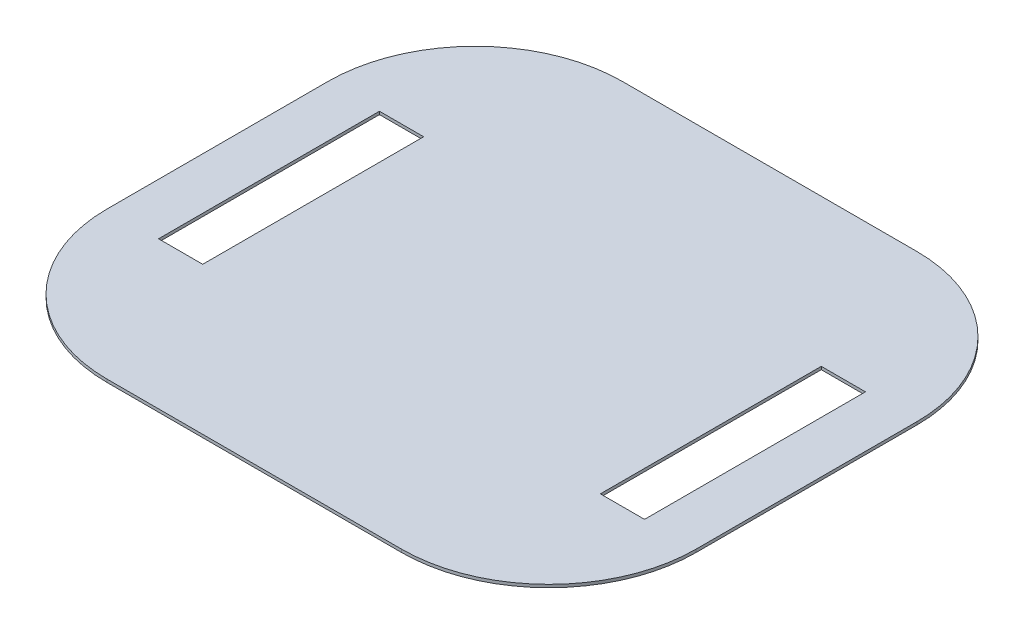
ISO-10303-21;
HEADER;
FILE_DESCRIPTION(('STEP AP214'),'2;1');
FILE_NAME('part.step','',(''),(''),'','','');
FILE_SCHEMA(('AUTOMOTIVE_DESIGN { 1 0 10303 214 1 1 1 1 }'));
ENDSEC;
DATA;
#1=APPLICATION_CONTEXT('core data for automotive mechanical design processes');
#2=APPLICATION_PROTOCOL_DEFINITION('international standard','automotive_design',2000,#1);
#3=PRODUCT_CONTEXT('',#1,'mechanical');
#4=PRODUCT('Part','Part','',(#3));
#5=PRODUCT_RELATED_PRODUCT_CATEGORY('part','',(#4));
#6=PRODUCT_DEFINITION_FORMATION('','',#4);
#7=PRODUCT_DEFINITION_CONTEXT('part definition',#1,'design');
#8=PRODUCT_DEFINITION('design','',#6,#7);
#9=PRODUCT_DEFINITION_SHAPE('','',#8);
#10=(LENGTH_UNIT() NAMED_UNIT(*) SI_UNIT(.MILLI.,.METRE.));
#11=(NAMED_UNIT(*) PLANE_ANGLE_UNIT() SI_UNIT($,.RADIAN.));
#12=(NAMED_UNIT(*) SI_UNIT($,.STERADIAN.) SOLID_ANGLE_UNIT());
#13=UNCERTAINTY_MEASURE_WITH_UNIT(LENGTH_MEASURE(1.E-05),#10,'distance_accuracy_value','');
#14=(GEOMETRIC_REPRESENTATION_CONTEXT(3) GLOBAL_UNCERTAINTY_ASSIGNED_CONTEXT((#13)) GLOBAL_UNIT_ASSIGNED_CONTEXT((#10,
#11,#12)) REPRESENTATION_CONTEXT('',''));
#15=CARTESIAN_POINT('',(0.,0.,0.));
#16=DIRECTION('',(0.,0.,1.));
#17=DIRECTION('',(1.,0.,0.));
#18=AXIS2_PLACEMENT_3D('',#15,#16,#17);
#19=CARTESIAN_POINT('',(200.,2.,-175.));
#20=DIRECTION('',(-1.,0.,0.));
#21=DIRECTION('',(0.,0.,1.));
#22=AXIS2_PLACEMENT_3D('',#19,#20,#21);
#23=PLANE('',#22);
#24=DIRECTION('',(0.,0.,-1.));
#25=VECTOR('',#24,1.);
#26=CARTESIAN_POINT('',(200.,2.,-175.));
#27=LINE('',#26,#25);
#28=CARTESIAN_POINT('',(200.,2.,74.9999999999999));
#29=VERTEX_POINT('',#28);
#30=CARTESIAN_POINT('',(200.,2.,-74.9999999999999));
#31=VERTEX_POINT('',#30);
#32=EDGE_CURVE('E226',#29,#31,#27,.T.);
#33=ORIENTED_EDGE('',*,*,#32,.F.);
#34=DIRECTION('',(0.,-1.,0.));
#35=VECTOR('',#34,1.);
#36=CARTESIAN_POINT('',(200.,2.,74.9999999999999));
#37=LINE('',#36,#35);
#38=CARTESIAN_POINT('',(200.,0.,74.9999999999999));
#39=VERTEX_POINT('',#38);
#40=EDGE_CURVE('E11',#29,#39,#37,.T.);
#41=ORIENTED_EDGE('',*,*,#40,.T.);
#42=DIRECTION('',(0.,0.,-1.));
#43=VECTOR('',#42,1.);
#44=CARTESIAN_POINT('',(200.,0.,-175.));
#45=LINE('',#44,#43);
#46=CARTESIAN_POINT('',(200.,0.,-74.9999999999999));
#47=VERTEX_POINT('',#46);
#48=EDGE_CURVE('E171',#39,#47,#45,.T.);
#49=ORIENTED_EDGE('',*,*,#48,.T.);
#50=DIRECTION('',(0.,-1.,0.));
#51=VECTOR('',#50,1.);
#52=CARTESIAN_POINT('',(200.,2.,-74.9999999999999));
#53=LINE('',#52,#51);
#54=EDGE_CURVE('E44',#47,#31,#53,.F.);
#55=ORIENTED_EDGE('',*,*,#54,.T.);
#56=EDGE_LOOP('',(#33,#41,#49,#55));
#57=FACE_BOUND('',#56,.T.);
#58=ADVANCED_FACE('F36',(#57),#23,.F.);
#59=CARTESIAN_POINT('',(-200.,2.,-175.));
#60=DIRECTION('',(0.,0.,1.));
#61=DIRECTION('',(1.,0.,0.));
#62=AXIS2_PLACEMENT_3D('',#59,#60,#61);
#63=PLANE('',#62);
#64=DIRECTION('',(-1.,0.,0.));
#65=VECTOR('',#64,1.);
#66=CARTESIAN_POINT('',(-200.,0.,-175.));
#67=LINE('',#66,#65);
#68=CARTESIAN_POINT('',(99.9999999999999,0.,-175.));
#69=VERTEX_POINT('',#68);
#70=CARTESIAN_POINT('',(-100.,0.,-175.));
#71=VERTEX_POINT('',#70);
#72=EDGE_CURVE('E240',#69,#71,#67,.T.);
#73=ORIENTED_EDGE('',*,*,#72,.T.);
#74=DIRECTION('',(0.,-1.,0.));
#75=VECTOR('',#74,1.);
#76=CARTESIAN_POINT('',(-100.,2.,-175.));
#77=LINE('',#76,#75);
#78=CARTESIAN_POINT('',(-100.,2.,-175.));
#79=VERTEX_POINT('',#78);
#80=EDGE_CURVE('E262',#71,#79,#77,.F.);
#81=ORIENTED_EDGE('',*,*,#80,.T.);
#82=DIRECTION('',(-1.,0.,0.));
#83=VECTOR('',#82,1.);
#84=CARTESIAN_POINT('',(-200.,2.,-175.));
#85=LINE('',#84,#83);
#86=CARTESIAN_POINT('',(99.9999999999999,2.,-175.));
#87=VERTEX_POINT('',#86);
#88=EDGE_CURVE('E229',#87,#79,#85,.T.);
#89=ORIENTED_EDGE('',*,*,#88,.F.);
#90=DIRECTION('',(0.,-1.,0.));
#91=VECTOR('',#90,1.);
#92=CARTESIAN_POINT('',(99.9999999999999,2.,-175.));
#93=LINE('',#92,#91);
#94=EDGE_CURVE('E259',#87,#69,#93,.T.);
#95=ORIENTED_EDGE('',*,*,#94,.T.);
#96=EDGE_LOOP('',(#73,#81,#89,#95));
#97=FACE_BOUND('',#96,.T.);
#98=ADVANCED_FACE('F287',(#97),#63,.F.);
#99=CARTESIAN_POINT('',(-200.,2.,-175.));
#100=DIRECTION('',(1.,0.,0.));
#101=DIRECTION('',(0.,0.,-1.));
#102=AXIS2_PLACEMENT_3D('',#99,#100,#101);
#103=PLANE('',#102);
#104=DIRECTION('',(0.,0.,1.));
#105=VECTOR('',#104,1.);
#106=CARTESIAN_POINT('',(-200.,2.,-175.));
#107=LINE('',#106,#105);
#108=CARTESIAN_POINT('',(-200.,2.,-74.9999999999999));
#109=VERTEX_POINT('',#108);
#110=CARTESIAN_POINT('',(-200.,2.,75.));
#111=VERTEX_POINT('',#110);
#112=EDGE_CURVE('E233',#109,#111,#107,.T.);
#113=ORIENTED_EDGE('',*,*,#112,.F.);
#114=DIRECTION('',(0.,-1.,0.));
#115=VECTOR('',#114,1.);
#116=CARTESIAN_POINT('',(-200.,2.,-74.9999999999999));
#117=LINE('',#116,#115);
#118=CARTESIAN_POINT('',(-200.,0.,-74.9999999999999));
#119=VERTEX_POINT('',#118);
#120=EDGE_CURVE('E248',#109,#119,#117,.T.);
#121=ORIENTED_EDGE('',*,*,#120,.T.);
#122=DIRECTION('',(0.,0.,1.));
#123=VECTOR('',#122,1.);
#124=CARTESIAN_POINT('',(-200.,0.,-175.));
#125=LINE('',#124,#123);
#126=CARTESIAN_POINT('',(-200.,0.,75.));
#127=VERTEX_POINT('',#126);
#128=EDGE_CURVE('E243',#119,#127,#125,.T.);
#129=ORIENTED_EDGE('',*,*,#128,.T.);
#130=DIRECTION('',(0.,-1.,0.));
#131=VECTOR('',#130,1.);
#132=CARTESIAN_POINT('',(-200.,2.,75.));
#133=LINE('',#132,#131);
#134=EDGE_CURVE('E237',#127,#111,#133,.F.);
#135=ORIENTED_EDGE('',*,*,#134,.T.);
#136=EDGE_LOOP('',(#113,#121,#129,#135));
#137=FACE_BOUND('',#136,.T.);
#138=ADVANCED_FACE('F297',(#137),#103,.F.);
#139=CARTESIAN_POINT('',(-200.,2.,175.));
#140=DIRECTION('',(0.,0.,-1.));
#141=DIRECTION('',(-1.,0.,0.));
#142=AXIS2_PLACEMENT_3D('',#139,#140,#141);
#143=PLANE('',#142);
#144=DIRECTION('',(1.,0.,0.));
#145=VECTOR('',#144,1.);
#146=CARTESIAN_POINT('',(-200.,2.,175.));
#147=LINE('',#146,#145);
#148=CARTESIAN_POINT('',(-100.,2.,175.));
#149=VERTEX_POINT('',#148);
#150=CARTESIAN_POINT('',(99.9999999999999,2.,175.));
#151=VERTEX_POINT('',#150);
#152=EDGE_CURVE('E235',#149,#151,#147,.T.);
#153=ORIENTED_EDGE('',*,*,#152,.F.);
#154=DIRECTION('',(0.,-1.,0.));
#155=VECTOR('',#154,1.);
#156=CARTESIAN_POINT('',(-100.,2.,175.));
#157=LINE('',#156,#155);
#158=CARTESIAN_POINT('',(-100.,0.,175.));
#159=VERTEX_POINT('',#158);
#160=EDGE_CURVE('E272',#149,#159,#157,.T.);
#161=ORIENTED_EDGE('',*,*,#160,.T.);
#162=DIRECTION('',(1.,0.,0.));
#163=VECTOR('',#162,1.);
#164=CARTESIAN_POINT('',(-200.,0.,175.));
#165=LINE('',#164,#163);
#166=CARTESIAN_POINT('',(99.9999999999999,0.,175.));
#167=VERTEX_POINT('',#166);
#168=EDGE_CURVE('E230',#159,#167,#165,.T.);
#169=ORIENTED_EDGE('',*,*,#168,.T.);
#170=DIRECTION('',(0.,-1.,0.));
#171=VECTOR('',#170,1.);
#172=CARTESIAN_POINT('',(99.9999999999999,2.,175.));
#173=LINE('',#172,#171);
#174=EDGE_CURVE('E51',#167,#151,#173,.F.);
#175=ORIENTED_EDGE('',*,*,#174,.T.);
#176=EDGE_LOOP('',(#153,#161,#169,#175));
#177=FACE_BOUND('',#176,.T.);
#178=ADVANCED_FACE('F303',(#177),#143,.F.);
#179=CARTESIAN_POINT('',(0.,2.,0.));
#180=DIRECTION('',(0.,1.,0.));
#181=DIRECTION('',(0.,0.,1.));
#182=AXIS2_PLACEMENT_3D('',#179,#180,#181);
#183=PLANE('',#182);
#184=DIRECTION('',(0.,0.,-1.));
#185=VECTOR('',#184,1.);
#186=CARTESIAN_POINT('',(-135.,2.,-74.9999999999999));
#187=LINE('',#186,#185);
#188=CARTESIAN_POINT('',(-135.,2.,75.0000000000001));
#189=VERTEX_POINT('',#188);
#190=CARTESIAN_POINT('',(-135.,2.,-74.9999999999999));
#191=VERTEX_POINT('',#190);
#192=EDGE_CURVE('E158',#189,#191,#187,.T.);
#193=ORIENTED_EDGE('',*,*,#192,.F.);
#194=DIRECTION('',(1.,0.,0.));
#195=VECTOR('',#194,1.);
#196=CARTESIAN_POINT('',(-165.,2.,75.0000000000001));
#197=LINE('',#196,#195);
#198=CARTESIAN_POINT('',(-165.,2.,75.0000000000001));
#199=VERTEX_POINT('',#198);
#200=EDGE_CURVE('E163',#199,#189,#197,.T.);
#201=ORIENTED_EDGE('',*,*,#200,.F.);
#202=DIRECTION('',(0.,0.,1.));
#203=VECTOR('',#202,1.);
#204=CARTESIAN_POINT('',(-165.,2.,-74.9999999999999));
#205=LINE('',#204,#203);
#206=CARTESIAN_POINT('',(-165.,2.,-74.9999999999999));
#207=VERTEX_POINT('',#206);
#208=EDGE_CURVE('E186',#207,#199,#205,.T.);
#209=ORIENTED_EDGE('',*,*,#208,.F.);
#210=DIRECTION('',(-1.,0.,0.));
#211=VECTOR('',#210,1.);
#212=CARTESIAN_POINT('',(-165.,2.,-74.9999999999999));
#213=LINE('',#212,#211);
#214=EDGE_CURVE('E179',#191,#207,#213,.T.);
#215=ORIENTED_EDGE('',*,*,#214,.F.);
#216=EDGE_LOOP('',(#193,#201,#209,#215));
#217=FACE_BOUND('',#216,.T.);
#218=DIRECTION('',(0.,0.,-1.));
#219=VECTOR('',#218,1.);
#220=CARTESIAN_POINT('',(165.,2.,-75.0000000000001));
#221=LINE('',#220,#219);
#222=CARTESIAN_POINT('',(165.,2.,74.9999999999999));
#223=VERTEX_POINT('',#222);
#224=CARTESIAN_POINT('',(165.,2.,-75.0000000000001));
#225=VERTEX_POINT('',#224);
#226=EDGE_CURVE('E203',#223,#225,#221,.T.);
#227=ORIENTED_EDGE('',*,*,#226,.F.);
#228=DIRECTION('',(1.,0.,0.));
#229=VECTOR('',#228,1.);
#230=CARTESIAN_POINT('',(135.,2.,74.9999999999999));
#231=LINE('',#230,#229);
#232=CARTESIAN_POINT('',(135.,2.,74.9999999999999));
#233=VERTEX_POINT('',#232);
#234=EDGE_CURVE('E211',#233,#223,#231,.T.);
#235=ORIENTED_EDGE('',*,*,#234,.F.);
#236=DIRECTION('',(0.,0.,1.));
#237=VECTOR('',#236,1.);
#238=CARTESIAN_POINT('',(135.,2.,-75.0000000000001));
#239=LINE('',#238,#237);
#240=CARTESIAN_POINT('',(135.,2.,-75.0000000000001));
#241=VERTEX_POINT('',#240);
#242=EDGE_CURVE('E208',#241,#233,#239,.T.);
#243=ORIENTED_EDGE('',*,*,#242,.F.);
#244=DIRECTION('',(-1.,0.,0.));
#245=VECTOR('',#244,1.);
#246=CARTESIAN_POINT('',(135.,2.,-75.0000000000001));
#247=LINE('',#246,#245);
#248=EDGE_CURVE('E205',#225,#241,#247,.T.);
#249=ORIENTED_EDGE('',*,*,#248,.F.);
#250=EDGE_LOOP('',(#227,#235,#243,#249));
#251=FACE_BOUND('',#250,.T.);
#252=ORIENTED_EDGE('',*,*,#88,.T.);
#253=CARTESIAN_POINT('',(-100.,2.,-74.9999999999999));
#254=DIRECTION('',(0.,1.,0.));
#255=DIRECTION('',(0.,0.,1.));
#256=AXIS2_PLACEMENT_3D('',#253,#254,#255);
#257=CIRCLE('',#256,100.);
#258=EDGE_CURVE('E269',#79,#109,#257,.T.);
#259=ORIENTED_EDGE('',*,*,#258,.T.);
#260=ORIENTED_EDGE('',*,*,#112,.T.);
#261=CARTESIAN_POINT('',(-100.,2.,74.9999999999999));
#262=DIRECTION('',(0.,1.,0.));
#263=DIRECTION('',(0.,0.,1.));
#264=AXIS2_PLACEMENT_3D('',#261,#262,#263);
#265=CIRCLE('',#264,100.);
#266=EDGE_CURVE('E58',#111,#149,#265,.T.);
#267=ORIENTED_EDGE('',*,*,#266,.T.);
#268=ORIENTED_EDGE('',*,*,#152,.T.);
#269=CARTESIAN_POINT('',(99.9999999999999,2.,74.9999999999999));
#270=DIRECTION('',(0.,1.,0.));
#271=DIRECTION('',(0.,0.,1.));
#272=AXIS2_PLACEMENT_3D('',#269,#270,#271);
#273=CIRCLE('',#272,100.);
#274=EDGE_CURVE('E266',#151,#29,#273,.T.);
#275=ORIENTED_EDGE('',*,*,#274,.T.);
#276=ORIENTED_EDGE('',*,*,#32,.T.);
#277=CARTESIAN_POINT('',(99.9999999999999,2.,-74.9999999999999));
#278=DIRECTION('',(0.,1.,0.));
#279=DIRECTION('',(0.,0.,1.));
#280=AXIS2_PLACEMENT_3D('',#277,#278,#279);
#281=CIRCLE('',#280,100.);
#282=EDGE_CURVE('E264',#31,#87,#281,.T.);
#283=ORIENTED_EDGE('',*,*,#282,.T.);
#284=EDGE_LOOP('',(#252,#259,#260,#267,#268,#275,#276,#283));
#285=FACE_BOUND('',#284,.T.);
#286=ADVANCED_FACE('F281',(#217,#251,#285),#183,.T.);
#287=CARTESIAN_POINT('',(0.,0.,0.));
#288=DIRECTION('',(0.,1.,0.));
#289=DIRECTION('',(0.,0.,1.));
#290=AXIS2_PLACEMENT_3D('',#287,#288,#289);
#291=PLANE('',#290);
#292=DIRECTION('',(-1.,0.,0.));
#293=VECTOR('',#292,1.);
#294=CARTESIAN_POINT('',(-165.,0.,75.0000000000001));
#295=LINE('',#294,#293);
#296=CARTESIAN_POINT('',(-135.,0.,75.0000000000001));
#297=VERTEX_POINT('',#296);
#298=CARTESIAN_POINT('',(-165.,0.,75.0000000000001));
#299=VERTEX_POINT('',#298);
#300=EDGE_CURVE('E177',#297,#299,#295,.T.);
#301=ORIENTED_EDGE('',*,*,#300,.F.);
#302=DIRECTION('',(0.,0.,1.));
#303=VECTOR('',#302,1.);
#304=CARTESIAN_POINT('',(-135.,0.,-74.9999999999999));
#305=LINE('',#304,#303);
#306=CARTESIAN_POINT('',(-135.,0.,-74.9999999999999));
#307=VERTEX_POINT('',#306);
#308=EDGE_CURVE('E155',#307,#297,#305,.T.);
#309=ORIENTED_EDGE('',*,*,#308,.F.);
#310=DIRECTION('',(1.,0.,0.));
#311=VECTOR('',#310,1.);
#312=CARTESIAN_POINT('',(-165.,0.,-74.9999999999999));
#313=LINE('',#312,#311);
#314=CARTESIAN_POINT('',(-165.,0.,-74.9999999999999));
#315=VERTEX_POINT('',#314);
#316=EDGE_CURVE('E167',#315,#307,#313,.T.);
#317=ORIENTED_EDGE('',*,*,#316,.F.);
#318=DIRECTION('',(0.,0.,-1.));
#319=VECTOR('',#318,1.);
#320=CARTESIAN_POINT('',(-165.,0.,-74.9999999999999));
#321=LINE('',#320,#319);
#322=EDGE_CURVE('E181',#299,#315,#321,.T.);
#323=ORIENTED_EDGE('',*,*,#322,.F.);
#324=EDGE_LOOP('',(#301,#309,#317,#323));
#325=FACE_BOUND('',#324,.T.);
#326=DIRECTION('',(-1.,0.,0.));
#327=VECTOR('',#326,1.);
#328=CARTESIAN_POINT('',(135.,0.,74.9999999999999));
#329=LINE('',#328,#327);
#330=CARTESIAN_POINT('',(165.,0.,74.9999999999999));
#331=VERTEX_POINT('',#330);
#332=CARTESIAN_POINT('',(135.,0.,74.9999999999999));
#333=VERTEX_POINT('',#332);
#334=EDGE_CURVE('E197',#331,#333,#329,.T.);
#335=ORIENTED_EDGE('',*,*,#334,.F.);
#336=DIRECTION('',(0.,0.,1.));
#337=VECTOR('',#336,1.);
#338=CARTESIAN_POINT('',(165.,0.,-75.0000000000001));
#339=LINE('',#338,#337);
#340=CARTESIAN_POINT('',(165.,0.,-75.0000000000001));
#341=VERTEX_POINT('',#340);
#342=EDGE_CURVE('E200',#341,#331,#339,.T.);
#343=ORIENTED_EDGE('',*,*,#342,.F.);
#344=DIRECTION('',(1.,0.,0.));
#345=VECTOR('',#344,1.);
#346=CARTESIAN_POINT('',(135.,0.,-75.0000000000001));
#347=LINE('',#346,#345);
#348=CARTESIAN_POINT('',(135.,0.,-75.0000000000001));
#349=VERTEX_POINT('',#348);
#350=EDGE_CURVE('E217',#349,#341,#347,.T.);
#351=ORIENTED_EDGE('',*,*,#350,.F.);
#352=DIRECTION('',(0.,0.,-1.));
#353=VECTOR('',#352,1.);
#354=CARTESIAN_POINT('',(135.,0.,-75.0000000000001));
#355=LINE('',#354,#353);
#356=EDGE_CURVE('E195',#333,#349,#355,.T.);
#357=ORIENTED_EDGE('',*,*,#356,.F.);
#358=EDGE_LOOP('',(#335,#343,#351,#357));
#359=FACE_BOUND('',#358,.T.);
#360=ORIENTED_EDGE('',*,*,#128,.F.);
#361=CARTESIAN_POINT('',(-100.,0.,-74.9999999999999));
#362=DIRECTION('',(0.,1.,0.));
#363=DIRECTION('',(0.,0.,1.));
#364=AXIS2_PLACEMENT_3D('',#361,#362,#363);
#365=CIRCLE('',#364,100.);
#366=EDGE_CURVE('E257',#119,#71,#365,.F.);
#367=ORIENTED_EDGE('',*,*,#366,.T.);
#368=ORIENTED_EDGE('',*,*,#72,.F.);
#369=CARTESIAN_POINT('',(99.9999999999999,0.,-74.9999999999999));
#370=DIRECTION('',(0.,1.,0.));
#371=DIRECTION('',(0.,0.,1.));
#372=AXIS2_PLACEMENT_3D('',#369,#370,#371);
#373=CIRCLE('',#372,100.);
#374=EDGE_CURVE('E251',#69,#47,#373,.F.);
#375=ORIENTED_EDGE('',*,*,#374,.T.);
#376=ORIENTED_EDGE('',*,*,#48,.F.);
#377=CARTESIAN_POINT('',(99.9999999999999,0.,74.9999999999999));
#378=DIRECTION('',(0.,1.,0.));
#379=DIRECTION('',(0.,0.,1.));
#380=AXIS2_PLACEMENT_3D('',#377,#378,#379);
#381=CIRCLE('',#380,100.);
#382=EDGE_CURVE('E253',#39,#167,#381,.F.);
#383=ORIENTED_EDGE('',*,*,#382,.T.);
#384=ORIENTED_EDGE('',*,*,#168,.F.);
#385=CARTESIAN_POINT('',(-100.,0.,74.9999999999999));
#386=DIRECTION('',(0.,1.,0.));
#387=DIRECTION('',(0.,0.,1.));
#388=AXIS2_PLACEMENT_3D('',#385,#386,#387);
#389=CIRCLE('',#388,100.);
#390=EDGE_CURVE('E255',#159,#127,#389,.F.);
#391=ORIENTED_EDGE('',*,*,#390,.T.);
#392=EDGE_LOOP('',(#360,#367,#368,#375,#376,#383,#384,#391));
#393=FACE_BOUND('',#392,.T.);
#394=ADVANCED_FACE('F174',(#325,#359,#393),#291,.F.);
#395=CARTESIAN_POINT('',(165.,-0.00100000000000013,-75.0000000000001));
#396=DIRECTION('',(1.,0.,0.));
#397=DIRECTION('',(0.,0.,-1.));
#398=AXIS2_PLACEMENT_3D('',#395,#396,#397);
#399=PLANE('',#398);
#400=ORIENTED_EDGE('',*,*,#342,.T.);
#401=DIRECTION('',(0.,1.,0.));
#402=VECTOR('',#401,1.);
#403=CARTESIAN_POINT('',(165.,-0.00100000000000013,74.9999999999999));
#404=LINE('',#403,#402);
#405=EDGE_CURVE('E215',#331,#223,#404,.T.);
#406=ORIENTED_EDGE('',*,*,#405,.T.);
#407=ORIENTED_EDGE('',*,*,#226,.T.);
#408=DIRECTION('',(0.,1.,0.));
#409=VECTOR('',#408,1.);
#410=CARTESIAN_POINT('',(165.,-0.00100000000000013,-75.0000000000001));
#411=LINE('',#410,#409);
#412=EDGE_CURVE('E214',#341,#225,#411,.T.);
#413=ORIENTED_EDGE('',*,*,#412,.F.);
#414=EDGE_LOOP('',(#400,#406,#407,#413));
#415=FACE_BOUND('',#414,.T.);
#416=ADVANCED_FACE('F341',(#415),#399,.F.);
#417=CARTESIAN_POINT('',(135.,-0.00100000000000013,74.9999999999999));
#418=DIRECTION('',(0.,0.,1.));
#419=DIRECTION('',(1.,0.,0.));
#420=AXIS2_PLACEMENT_3D('',#417,#418,#419);
#421=PLANE('',#420);
#422=ORIENTED_EDGE('',*,*,#334,.T.);
#423=DIRECTION('',(0.,1.,0.));
#424=VECTOR('',#423,1.);
#425=CARTESIAN_POINT('',(135.,-0.00100000000000013,74.9999999999999));
#426=LINE('',#425,#424);
#427=EDGE_CURVE('E218',#333,#233,#426,.T.);
#428=ORIENTED_EDGE('',*,*,#427,.T.);
#429=ORIENTED_EDGE('',*,*,#234,.T.);
#430=ORIENTED_EDGE('',*,*,#405,.F.);
#431=EDGE_LOOP('',(#422,#428,#429,#430));
#432=FACE_BOUND('',#431,.T.);
#433=ADVANCED_FACE('F337',(#432),#421,.F.);
#434=CARTESIAN_POINT('',(135.,-0.00100000000000013,-75.0000000000001));
#435=DIRECTION('',(-1.,0.,0.));
#436=DIRECTION('',(0.,0.,1.));
#437=AXIS2_PLACEMENT_3D('',#434,#435,#436);
#438=PLANE('',#437);
#439=ORIENTED_EDGE('',*,*,#356,.T.);
#440=DIRECTION('',(0.,1.,0.));
#441=VECTOR('',#440,1.);
#442=CARTESIAN_POINT('',(135.,-0.00100000000000013,-75.0000000000001));
#443=LINE('',#442,#441);
#444=EDGE_CURVE('E220',#349,#241,#443,.T.);
#445=ORIENTED_EDGE('',*,*,#444,.T.);
#446=ORIENTED_EDGE('',*,*,#242,.T.);
#447=ORIENTED_EDGE('',*,*,#427,.F.);
#448=EDGE_LOOP('',(#439,#445,#446,#447));
#449=FACE_BOUND('',#448,.T.);
#450=ADVANCED_FACE('F340',(#449),#438,.F.);
#451=CARTESIAN_POINT('',(135.,-0.00100000000000013,-75.0000000000001));
#452=DIRECTION('',(0.,0.,-1.));
#453=DIRECTION('',(-1.,0.,0.));
#454=AXIS2_PLACEMENT_3D('',#451,#452,#453);
#455=PLANE('',#454);
#456=ORIENTED_EDGE('',*,*,#350,.T.);
#457=ORIENTED_EDGE('',*,*,#412,.T.);
#458=ORIENTED_EDGE('',*,*,#248,.T.);
#459=ORIENTED_EDGE('',*,*,#444,.F.);
#460=EDGE_LOOP('',(#456,#457,#458,#459));
#461=FACE_BOUND('',#460,.T.);
#462=ADVANCED_FACE('F336',(#461),#455,.F.);
#463=CARTESIAN_POINT('',(-135.,-0.00100000000000013,-74.9999999999999));
#464=DIRECTION('',(1.,0.,0.));
#465=DIRECTION('',(0.,0.,-1.));
#466=AXIS2_PLACEMENT_3D('',#463,#464,#465);
#467=PLANE('',#466);
#468=ORIENTED_EDGE('',*,*,#308,.T.);
#469=DIRECTION('',(0.,1.,0.));
#470=VECTOR('',#469,1.);
#471=CARTESIAN_POINT('',(-135.,-0.00100000000000013,75.0000000000001));
#472=LINE('',#471,#470);
#473=EDGE_CURVE('E172',#297,#189,#472,.T.);
#474=ORIENTED_EDGE('',*,*,#473,.T.);
#475=ORIENTED_EDGE('',*,*,#192,.T.);
#476=DIRECTION('',(0.,1.,0.));
#477=VECTOR('',#476,1.);
#478=CARTESIAN_POINT('',(-135.,-0.00100000000000013,-74.9999999999999));
#479=LINE('',#478,#477);
#480=EDGE_CURVE('E151',#307,#191,#479,.T.);
#481=ORIENTED_EDGE('',*,*,#480,.F.);
#482=EDGE_LOOP('',(#468,#474,#475,#481));
#483=FACE_BOUND('',#482,.T.);
#484=ADVANCED_FACE('F153',(#483),#467,.F.);
#485=CARTESIAN_POINT('',(-165.,-0.00100000000000013,75.0000000000001));
#486=DIRECTION('',(0.,0.,1.));
#487=DIRECTION('',(1.,0.,0.));
#488=AXIS2_PLACEMENT_3D('',#485,#486,#487);
#489=PLANE('',#488);
#490=ORIENTED_EDGE('',*,*,#300,.T.);
#491=DIRECTION('',(0.,1.,0.));
#492=VECTOR('',#491,1.);
#493=CARTESIAN_POINT('',(-165.,-0.00100000000000013,75.0000000000001));
#494=LINE('',#493,#492);
#495=EDGE_CURVE('E192',#299,#199,#494,.T.);
#496=ORIENTED_EDGE('',*,*,#495,.T.);
#497=ORIENTED_EDGE('',*,*,#200,.T.);
#498=ORIENTED_EDGE('',*,*,#473,.F.);
#499=EDGE_LOOP('',(#490,#496,#497,#498));
#500=FACE_BOUND('',#499,.T.);
#501=ADVANCED_FACE('F329',(#500),#489,.F.);
#502=CARTESIAN_POINT('',(-165.,-0.00100000000000013,-74.9999999999999));
#503=DIRECTION('',(-1.,0.,0.));
#504=DIRECTION('',(0.,0.,1.));
#505=AXIS2_PLACEMENT_3D('',#502,#503,#504);
#506=PLANE('',#505);
#507=ORIENTED_EDGE('',*,*,#322,.T.);
#508=DIRECTION('',(0.,1.,0.));
#509=VECTOR('',#508,1.);
#510=CARTESIAN_POINT('',(-165.,-0.00100000000000013,-74.9999999999999));
#511=LINE('',#510,#509);
#512=EDGE_CURVE('E162',#315,#207,#511,.T.);
#513=ORIENTED_EDGE('',*,*,#512,.T.);
#514=ORIENTED_EDGE('',*,*,#208,.T.);
#515=ORIENTED_EDGE('',*,*,#495,.F.);
#516=EDGE_LOOP('',(#507,#513,#514,#515));
#517=FACE_BOUND('',#516,.T.);
#518=ADVANCED_FACE('F324',(#517),#506,.F.);
#519=CARTESIAN_POINT('',(-165.,-0.00100000000000013,-74.9999999999999));
#520=DIRECTION('',(0.,0.,-1.));
#521=DIRECTION('',(-1.,0.,0.));
#522=AXIS2_PLACEMENT_3D('',#519,#520,#521);
#523=PLANE('',#522);
#524=ORIENTED_EDGE('',*,*,#316,.T.);
#525=ORIENTED_EDGE('',*,*,#480,.T.);
#526=ORIENTED_EDGE('',*,*,#214,.T.);
#527=ORIENTED_EDGE('',*,*,#512,.F.);
#528=EDGE_LOOP('',(#524,#525,#526,#527));
#529=FACE_BOUND('',#528,.T.);
#530=ADVANCED_FACE('F168',(#529),#523,.F.);
#531=CARTESIAN_POINT('',(-100.,2.,-74.9999999999999));
#532=DIRECTION('',(0.,-1.,0.));
#533=DIRECTION('',(0.,0.,-1.));
#534=AXIS2_PLACEMENT_3D('',#531,#532,#533);
#535=CYLINDRICAL_SURFACE('',#534,100.);
#536=ORIENTED_EDGE('',*,*,#258,.F.);
#537=ORIENTED_EDGE('',*,*,#80,.F.);
#538=ORIENTED_EDGE('',*,*,#366,.F.);
#539=ORIENTED_EDGE('',*,*,#120,.F.);
#540=EDGE_LOOP('',(#536,#537,#538,#539));
#541=FACE_BOUND('',#540,.T.);
#542=ADVANCED_FACE('F294',(#541),#535,.T.);
#543=CARTESIAN_POINT('',(-100.,2.,74.9999999999999));
#544=DIRECTION('',(0.,-1.,0.));
#545=DIRECTION('',(0.,0.,-1.));
#546=AXIS2_PLACEMENT_3D('',#543,#544,#545);
#547=CYLINDRICAL_SURFACE('',#546,100.);
#548=ORIENTED_EDGE('',*,*,#266,.F.);
#549=ORIENTED_EDGE('',*,*,#134,.F.);
#550=ORIENTED_EDGE('',*,*,#390,.F.);
#551=ORIENTED_EDGE('',*,*,#160,.F.);
#552=EDGE_LOOP('',(#548,#549,#550,#551));
#553=FACE_BOUND('',#552,.T.);
#554=ADVANCED_FACE('F301',(#553),#547,.T.);
#555=CARTESIAN_POINT('',(99.9999999999999,2.,74.9999999999999));
#556=DIRECTION('',(0.,-1.,0.));
#557=DIRECTION('',(0.,0.,-1.));
#558=AXIS2_PLACEMENT_3D('',#555,#556,#557);
#559=CYLINDRICAL_SURFACE('',#558,100.);
#560=ORIENTED_EDGE('',*,*,#274,.F.);
#561=ORIENTED_EDGE('',*,*,#174,.F.);
#562=ORIENTED_EDGE('',*,*,#382,.F.);
#563=ORIENTED_EDGE('',*,*,#40,.F.);
#564=EDGE_LOOP('',(#560,#561,#562,#563));
#565=FACE_BOUND('',#564,.T.);
#566=ADVANCED_FACE('F305',(#565),#559,.T.);
#567=CARTESIAN_POINT('',(99.9999999999999,2.,-74.9999999999999));
#568=DIRECTION('',(0.,-1.,0.));
#569=DIRECTION('',(0.,0.,-1.));
#570=AXIS2_PLACEMENT_3D('',#567,#568,#569);
#571=CYLINDRICAL_SURFACE('',#570,100.);
#572=ORIENTED_EDGE('',*,*,#282,.F.);
#573=ORIENTED_EDGE('',*,*,#54,.F.);
#574=ORIENTED_EDGE('',*,*,#374,.F.);
#575=ORIENTED_EDGE('',*,*,#94,.F.);
#576=EDGE_LOOP('',(#572,#573,#574,#575));
#577=FACE_BOUND('',#576,.T.);
#578=ADVANCED_FACE('F38',(#577),#571,.T.);
#579=CLOSED_SHELL('',(#58,#98,#138,#178,#286,#394,#416,#433,#450,#462,#484,#501,#518,#530,#542,
#554,#566,#578));
#580=MANIFOLD_SOLID_BREP('B2',#579);
#581=ADVANCED_BREP_SHAPE_REPRESENTATION('',(#18,#580),#14);
#582=SHAPE_DEFINITION_REPRESENTATION(#9,#581);
ENDSEC;
END-ISO-10303-21;
